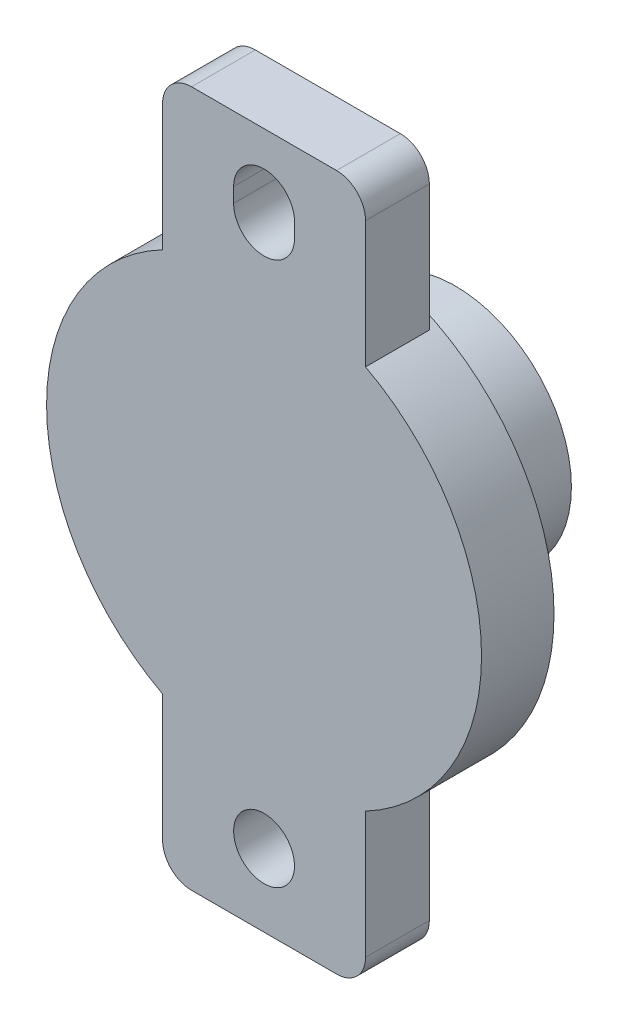
ISO-10303-21;
HEADER;
FILE_DESCRIPTION(('STEP AP214'),'2;1');
FILE_NAME('part.step','',(''),(''),'','','');
FILE_SCHEMA(('AUTOMOTIVE_DESIGN { 1 0 10303 214 1 1 1 1 }'));
ENDSEC;
DATA;
#1=APPLICATION_CONTEXT('core data for automotive mechanical design processes');
#2=APPLICATION_PROTOCOL_DEFINITION('international standard','automotive_design',2000,#1);
#3=PRODUCT_CONTEXT('',#1,'mechanical');
#4=PRODUCT('Part','Part','',(#3));
#5=PRODUCT_RELATED_PRODUCT_CATEGORY('part','',(#4));
#6=PRODUCT_DEFINITION_FORMATION('','',#4);
#7=PRODUCT_DEFINITION_CONTEXT('part definition',#1,'design');
#8=PRODUCT_DEFINITION('design','',#6,#7);
#9=PRODUCT_DEFINITION_SHAPE('','',#8);
#10=(LENGTH_UNIT() NAMED_UNIT(*) SI_UNIT(.MILLI.,.METRE.));
#11=(NAMED_UNIT(*) PLANE_ANGLE_UNIT() SI_UNIT($,.RADIAN.));
#12=(NAMED_UNIT(*) SI_UNIT($,.STERADIAN.) SOLID_ANGLE_UNIT());
#13=UNCERTAINTY_MEASURE_WITH_UNIT(LENGTH_MEASURE(1.E-05),#10,'distance_accuracy_value','');
#14=(GEOMETRIC_REPRESENTATION_CONTEXT(3) GLOBAL_UNCERTAINTY_ASSIGNED_CONTEXT((#13)) GLOBAL_UNIT_ASSIGNED_CONTEXT((#10,
#11,#12)) REPRESENTATION_CONTEXT('',''));
#15=CARTESIAN_POINT('',(0.,0.,0.));
#16=DIRECTION('',(0.,0.,1.));
#17=DIRECTION('',(1.,0.,0.));
#18=AXIS2_PLACEMENT_3D('',#15,#16,#17);
#19=CARTESIAN_POINT('',(0.,0.,-0.3));
#20=DIRECTION('',(0.,0.,1.));
#21=DIRECTION('',(1.,0.,0.));
#22=AXIS2_PLACEMENT_3D('',#19,#20,#21);
#23=PLANE('',#22);
#24=CARTESIAN_POINT('',(0.,0.,-0.3));
#25=DIRECTION('',(0.,0.,1.));
#26=DIRECTION('',(1.,0.,0.));
#27=AXIS2_PLACEMENT_3D('',#24,#25,#26);
#28=CIRCLE('',#27,7.5);
#29=CARTESIAN_POINT('',(7.5,0.,-0.3));
#30=VERTEX_POINT('',#29);
#31=EDGE_CURVE('E233',#30,#30,#28,.T.);
#32=ORIENTED_EDGE('',*,*,#31,.F.);
#33=EDGE_LOOP('',(#32));
#34=FACE_BOUND('',#33,.T.);
#35=CARTESIAN_POINT('',(0.,0.,-0.3));
#36=DIRECTION('',(0.,0.,1.));
#37=DIRECTION('',(1.,0.,0.));
#38=AXIS2_PLACEMENT_3D('',#35,#36,#37);
#39=CIRCLE('',#38,1.8);
#40=CARTESIAN_POINT('',(-1.29518338469886,1.25,-0.3));
#41=VERTEX_POINT('',#40);
#42=CARTESIAN_POINT('',(-1.29518338469886,-1.25,-0.3));
#43=VERTEX_POINT('',#42);
#44=EDGE_CURVE('E55',#41,#43,#39,.T.);
#45=ORIENTED_EDGE('',*,*,#44,.T.);
#46=DIRECTION('',(1.,0.,0.));
#47=VECTOR('',#46,1.);
#48=CARTESIAN_POINT('',(-1.29518338469886,-1.25,-0.3));
#49=LINE('',#48,#47);
#50=CARTESIAN_POINT('',(1.29518338469886,-1.25,-0.3));
#51=VERTEX_POINT('',#50);
#52=EDGE_CURVE('E639',#43,#51,#49,.T.);
#53=ORIENTED_EDGE('',*,*,#52,.T.);
#54=CARTESIAN_POINT('',(0.,0.,-0.3));
#55=DIRECTION('',(0.,0.,1.));
#56=DIRECTION('',(1.,0.,0.));
#57=AXIS2_PLACEMENT_3D('',#54,#55,#56);
#58=CIRCLE('',#57,1.8);
#59=CARTESIAN_POINT('',(1.29518338469886,1.25,-0.3));
#60=VERTEX_POINT('',#59);
#61=EDGE_CURVE('E200',#51,#60,#58,.T.);
#62=ORIENTED_EDGE('',*,*,#61,.T.);
#63=DIRECTION('',(-1.,0.,0.));
#64=VECTOR('',#63,1.);
#65=CARTESIAN_POINT('',(-1.29518338469886,1.25,-0.3));
#66=LINE('',#65,#64);
#67=EDGE_CURVE('E187',#60,#41,#66,.T.);
#68=ORIENTED_EDGE('',*,*,#67,.T.);
#69=EDGE_LOOP('',(#45,#53,#62,#68));
#70=FACE_BOUND('',#69,.T.);
#71=ADVANCED_FACE('F33',(#34,#70),#23,.F.);
#72=CARTESIAN_POINT('',(0.,0.,0.));
#73=DIRECTION('',(0.,0.,1.));
#74=DIRECTION('',(1.,0.,0.));
#75=AXIS2_PLACEMENT_3D('',#72,#73,#74);
#76=PLANE('',#75);
#77=DIRECTION('',(0.,-1.,0.));
#78=VECTOR('',#77,1.);
#79=CARTESIAN_POINT('',(1.05,9.74584047482982,0.));
#80=LINE('',#79,#78);
#81=CARTESIAN_POINT('',(1.05,9.74584047482982,0.));
#82=VERTEX_POINT('',#81);
#83=CARTESIAN_POINT('',(1.05,9.24584047482982,0.));
#84=VERTEX_POINT('',#83);
#85=EDGE_CURVE('E208',#82,#84,#80,.T.);
#86=ORIENTED_EDGE('',*,*,#85,.F.);
#87=CARTESIAN_POINT('',(0.,9.74584047482982,0.));
#88=DIRECTION('',(0.,0.,-1.));
#89=DIRECTION('',(-1.,0.,0.));
#90=AXIS2_PLACEMENT_3D('',#87,#88,#89);
#91=CIRCLE('',#90,1.05);
#92=CARTESIAN_POINT('',(-1.05,9.74584047482982,0.));
#93=VERTEX_POINT('',#92);
#94=EDGE_CURVE('E206',#93,#82,#91,.T.);
#95=ORIENTED_EDGE('',*,*,#94,.F.);
#96=DIRECTION('',(0.,1.,0.));
#97=VECTOR('',#96,1.);
#98=CARTESIAN_POINT('',(-1.05,9.74584047482982,0.));
#99=LINE('',#98,#97);
#100=CARTESIAN_POINT('',(-1.05,9.24584047482982,0.));
#101=VERTEX_POINT('',#100);
#102=EDGE_CURVE('E214',#101,#93,#99,.T.);
#103=ORIENTED_EDGE('',*,*,#102,.F.);
#104=CARTESIAN_POINT('',(0.,9.24584047482982,0.));
#105=DIRECTION('',(0.,0.,-1.));
#106=DIRECTION('',(-1.,0.,0.));
#107=AXIS2_PLACEMENT_3D('',#104,#105,#106);
#108=CIRCLE('',#107,1.05);
#109=EDGE_CURVE('E211',#84,#101,#108,.T.);
#110=ORIENTED_EDGE('',*,*,#109,.F.);
#111=EDGE_LOOP('',(#86,#95,#103,#110));
#112=FACE_BOUND('',#111,.T.);
#113=DIRECTION('',(0.,-1.,0.));
#114=VECTOR('',#113,1.);
#115=CARTESIAN_POINT('',(-3.5,12.,0.));
#116=LINE('',#115,#114);
#117=CARTESIAN_POINT('',(-3.5,11.,0.));
#118=VERTEX_POINT('',#117);
#119=CARTESIAN_POINT('',(-3.5,6.6332495807108,0.));
#120=VERTEX_POINT('',#119);
#121=EDGE_CURVE('E238',#118,#120,#116,.T.);
#122=ORIENTED_EDGE('',*,*,#121,.F.);
#123=CARTESIAN_POINT('',(-2.5,11.,0.));
#124=DIRECTION('',(0.,0.,1.));
#125=DIRECTION('',(1.,0.,0.));
#126=AXIS2_PLACEMENT_3D('',#123,#124,#125);
#127=CIRCLE('',#126,1.);
#128=CARTESIAN_POINT('',(-2.5,12.,0.));
#129=VERTEX_POINT('',#128);
#130=EDGE_CURVE('E317',#118,#129,#127,.F.);
#131=ORIENTED_EDGE('',*,*,#130,.T.);
#132=DIRECTION('',(-1.,0.,0.));
#133=VECTOR('',#132,1.);
#134=CARTESIAN_POINT('',(-3.5,12.,0.));
#135=LINE('',#134,#133);
#136=CARTESIAN_POINT('',(2.5,12.,0.));
#137=VERTEX_POINT('',#136);
#138=EDGE_CURVE('E242',#137,#129,#135,.T.);
#139=ORIENTED_EDGE('',*,*,#138,.F.);
#140=CARTESIAN_POINT('',(2.5,11.,0.));
#141=DIRECTION('',(0.,0.,1.));
#142=DIRECTION('',(1.,0.,0.));
#143=AXIS2_PLACEMENT_3D('',#140,#141,#142);
#144=CIRCLE('',#143,1.);
#145=CARTESIAN_POINT('',(3.5,11.,0.));
#146=VERTEX_POINT('',#145);
#147=EDGE_CURVE('E315',#137,#146,#144,.F.);
#148=ORIENTED_EDGE('',*,*,#147,.T.);
#149=DIRECTION('',(0.,1.,0.));
#150=VECTOR('',#149,1.);
#151=CARTESIAN_POINT('',(3.5,12.,0.));
#152=LINE('',#151,#150);
#153=CARTESIAN_POINT('',(3.5,6.6332495807108,0.));
#154=VERTEX_POINT('',#153);
#155=EDGE_CURVE('E270',#154,#146,#152,.T.);
#156=ORIENTED_EDGE('',*,*,#155,.F.);
#157=CARTESIAN_POINT('',(0.,0.,0.));
#158=DIRECTION('',(0.,0.,1.));
#159=DIRECTION('',(1.,0.,0.));
#160=AXIS2_PLACEMENT_3D('',#157,#158,#159);
#161=CIRCLE('',#160,7.5);
#162=EDGE_CURVE('E289',#154,#120,#161,.T.);
#163=ORIENTED_EDGE('',*,*,#162,.T.);
#164=EDGE_LOOP('',(#122,#131,#139,#148,#156,#163));
#165=FACE_BOUND('',#164,.T.);
#166=ADVANCED_FACE('F342',(#112,#165),#76,.F.);
#167=CARTESIAN_POINT('',(-3.5,12.,2.2));
#168=DIRECTION('',(1.,0.,0.));
#169=DIRECTION('',(0.,1.,0.));
#170=AXIS2_PLACEMENT_3D('',#167,#168,#169);
#171=PLANE('',#170);
#172=DIRECTION('',(0.,-1.,0.));
#173=VECTOR('',#172,1.);
#174=CARTESIAN_POINT('',(-3.5,12.,2.2));
#175=LINE('',#174,#173);
#176=CARTESIAN_POINT('',(-3.5,11.,2.2));
#177=VERTEX_POINT('',#176);
#178=CARTESIAN_POINT('',(-3.5,6.6332495807108,2.2));
#179=VERTEX_POINT('',#178);
#180=EDGE_CURVE('E239',#177,#179,#175,.T.);
#181=ORIENTED_EDGE('',*,*,#180,.F.);
#182=DIRECTION('',(0.,0.,-1.));
#183=VECTOR('',#182,1.);
#184=CARTESIAN_POINT('',(-3.5,11.,2.2));
#185=LINE('',#184,#183);
#186=EDGE_CURVE('E312',#177,#118,#185,.T.);
#187=ORIENTED_EDGE('',*,*,#186,.T.);
#188=ORIENTED_EDGE('',*,*,#121,.T.);
#189=DIRECTION('',(0.,0.,-1.));
#190=VECTOR('',#189,1.);
#191=CARTESIAN_POINT('',(-3.5,6.6332495807108,2.2));
#192=LINE('',#191,#190);
#193=EDGE_CURVE('E283',#179,#120,#192,.T.);
#194=ORIENTED_EDGE('',*,*,#193,.F.);
#195=EDGE_LOOP('',(#181,#187,#188,#194));
#196=FACE_BOUND('',#195,.T.);
#197=ADVANCED_FACE('F350',(#196),#171,.F.);
#198=CARTESIAN_POINT('',(-3.5,-6.6332495807108,2.2));
#199=DIRECTION('',(1.,0.,0.));
#200=DIRECTION('',(0.,1.,0.));
#201=AXIS2_PLACEMENT_3D('',#198,#199,#200);
#202=PLANE('',#201);
#203=DIRECTION('',(0.,-1.,0.));
#204=VECTOR('',#203,1.);
#205=CARTESIAN_POINT('',(-3.5,-6.6332495807108,0.));
#206=LINE('',#205,#204);
#207=CARTESIAN_POINT('',(-3.5,-6.6332495807108,0.));
#208=VERTEX_POINT('',#207);
#209=CARTESIAN_POINT('',(-3.5,-11.,0.));
#210=VERTEX_POINT('',#209);
#211=EDGE_CURVE('E262',#208,#210,#206,.T.);
#212=ORIENTED_EDGE('',*,*,#211,.T.);
#213=DIRECTION('',(0.,0.,-1.));
#214=VECTOR('',#213,1.);
#215=CARTESIAN_POINT('',(-3.5,-11.,2.2));
#216=LINE('',#215,#214);
#217=CARTESIAN_POINT('',(-3.5,-11.,2.2));
#218=VERTEX_POINT('',#217);
#219=EDGE_CURVE('E310',#210,#218,#216,.F.);
#220=ORIENTED_EDGE('',*,*,#219,.T.);
#221=DIRECTION('',(0.,-1.,0.));
#222=VECTOR('',#221,1.);
#223=CARTESIAN_POINT('',(-3.5,-6.6332495807108,2.2));
#224=LINE('',#223,#222);
#225=CARTESIAN_POINT('',(-3.5,-6.6332495807108,2.2));
#226=VERTEX_POINT('',#225);
#227=EDGE_CURVE('E244',#226,#218,#224,.T.);
#228=ORIENTED_EDGE('',*,*,#227,.F.);
#229=DIRECTION('',(0.,0.,-1.));
#230=VECTOR('',#229,1.);
#231=CARTESIAN_POINT('',(-3.5,-6.6332495807108,2.2));
#232=LINE('',#231,#230);
#233=EDGE_CURVE('E280',#226,#208,#232,.T.);
#234=ORIENTED_EDGE('',*,*,#233,.T.);
#235=EDGE_LOOP('',(#212,#220,#228,#234));
#236=FACE_BOUND('',#235,.T.);
#237=ADVANCED_FACE('F360',(#236),#202,.F.);
#238=CARTESIAN_POINT('',(-3.5,-12.,2.2));
#239=DIRECTION('',(0.,1.,0.));
#240=DIRECTION('',(0.,0.,1.));
#241=AXIS2_PLACEMENT_3D('',#238,#239,#240);
#242=PLANE('',#241);
#243=DIRECTION('',(1.,0.,0.));
#244=VECTOR('',#243,1.);
#245=CARTESIAN_POINT('',(-3.5,-12.,0.));
#246=LINE('',#245,#244);
#247=CARTESIAN_POINT('',(-2.5,-12.,0.));
#248=VERTEX_POINT('',#247);
#249=CARTESIAN_POINT('',(2.5,-12.,0.));
#250=VERTEX_POINT('',#249);
#251=EDGE_CURVE('E265',#248,#250,#246,.T.);
#252=ORIENTED_EDGE('',*,*,#251,.T.);
#253=DIRECTION('',(0.,0.,-1.));
#254=VECTOR('',#253,1.);
#255=CARTESIAN_POINT('',(2.5,-12.,2.2));
#256=LINE('',#255,#254);
#257=CARTESIAN_POINT('',(2.5,-12.,2.2));
#258=VERTEX_POINT('',#257);
#259=EDGE_CURVE('E300',#250,#258,#256,.F.);
#260=ORIENTED_EDGE('',*,*,#259,.T.);
#261=DIRECTION('',(1.,0.,0.));
#262=VECTOR('',#261,1.);
#263=CARTESIAN_POINT('',(-3.5,-12.,2.2));
#264=LINE('',#263,#262);
#265=CARTESIAN_POINT('',(-2.5,-12.,2.2));
#266=VERTEX_POINT('',#265);
#267=EDGE_CURVE('E247',#266,#258,#264,.T.);
#268=ORIENTED_EDGE('',*,*,#267,.F.);
#269=DIRECTION('',(0.,0.,-1.));
#270=VECTOR('',#269,1.);
#271=CARTESIAN_POINT('',(-2.5,-12.,2.2));
#272=LINE('',#271,#270);
#273=EDGE_CURVE('E297',#266,#248,#272,.T.);
#274=ORIENTED_EDGE('',*,*,#273,.T.);
#275=EDGE_LOOP('',(#252,#260,#268,#274));
#276=FACE_BOUND('',#275,.T.);
#277=ADVANCED_FACE('F369',(#276),#242,.F.);
#278=CARTESIAN_POINT('',(3.5,-6.6332495807108,2.2));
#279=DIRECTION('',(-1.,0.,0.));
#280=DIRECTION('',(0.,-1.,0.));
#281=AXIS2_PLACEMENT_3D('',#278,#279,#280);
#282=PLANE('',#281);
#283=DIRECTION('',(0.,1.,0.));
#284=VECTOR('',#283,1.);
#285=CARTESIAN_POINT('',(3.5,-6.6332495807108,2.2));
#286=LINE('',#285,#284);
#287=CARTESIAN_POINT('',(3.5,-11.,2.2));
#288=VERTEX_POINT('',#287);
#289=CARTESIAN_POINT('',(3.5,-6.6332495807108,2.2));
#290=VERTEX_POINT('',#289);
#291=EDGE_CURVE('E250',#288,#290,#286,.T.);
#292=ORIENTED_EDGE('',*,*,#291,.F.);
#293=DIRECTION('',(0.,0.,-1.));
#294=VECTOR('',#293,1.);
#295=CARTESIAN_POINT('',(3.5,-11.,2.2));
#296=LINE('',#295,#294);
#297=CARTESIAN_POINT('',(3.5,-11.,0.));
#298=VERTEX_POINT('',#297);
#299=EDGE_CURVE('E290',#288,#298,#296,.T.);
#300=ORIENTED_EDGE('',*,*,#299,.T.);
#301=DIRECTION('',(0.,1.,0.));
#302=VECTOR('',#301,1.);
#303=CARTESIAN_POINT('',(3.5,-6.6332495807108,0.));
#304=LINE('',#303,#302);
#305=CARTESIAN_POINT('',(3.5,-6.6332495807108,0.));
#306=VERTEX_POINT('',#305);
#307=EDGE_CURVE('E268',#298,#306,#304,.T.);
#308=ORIENTED_EDGE('',*,*,#307,.T.);
#309=DIRECTION('',(0.,0.,-1.));
#310=VECTOR('',#309,1.);
#311=CARTESIAN_POINT('',(3.5,-6.6332495807108,2.2));
#312=LINE('',#311,#310);
#313=EDGE_CURVE('E277',#290,#306,#312,.T.);
#314=ORIENTED_EDGE('',*,*,#313,.F.);
#315=EDGE_LOOP('',(#292,#300,#308,#314));
#316=FACE_BOUND('',#315,.T.);
#317=ADVANCED_FACE('F380',(#316),#282,.F.);
#318=CARTESIAN_POINT('',(0.,0.,2.2));
#319=DIRECTION('',(0.,0.,-1.));
#320=DIRECTION('',(-1.,0.,0.));
#321=AXIS2_PLACEMENT_3D('',#318,#319,#320);
#322=CYLINDRICAL_SURFACE('',#321,7.5);
#323=ORIENTED_EDGE('',*,*,#313,.T.);
#324=EDGE_CURVE('E286',#208,#306,#161,.T.);
#325=ORIENTED_EDGE('',*,*,#324,.F.);
#326=ORIENTED_EDGE('',*,*,#233,.F.);
#327=CARTESIAN_POINT('',(0.,0.,2.2));
#328=DIRECTION('',(0.,0.,1.));
#329=DIRECTION('',(1.,0.,0.));
#330=AXIS2_PLACEMENT_3D('',#327,#328,#329);
#331=CIRCLE('',#330,7.5);
#332=EDGE_CURVE('E241',#179,#226,#331,.T.);
#333=ORIENTED_EDGE('',*,*,#332,.F.);
#334=ORIENTED_EDGE('',*,*,#193,.T.);
#335=ORIENTED_EDGE('',*,*,#162,.F.);
#336=DIRECTION('',(0.,0.,-1.));
#337=VECTOR('',#336,1.);
#338=CARTESIAN_POINT('',(3.5,6.6332495807108,2.2));
#339=LINE('',#338,#337);
#340=CARTESIAN_POINT('',(3.5,6.6332495807108,2.2));
#341=VERTEX_POINT('',#340);
#342=EDGE_CURVE('E260',#341,#154,#339,.T.);
#343=ORIENTED_EDGE('',*,*,#342,.F.);
#344=CARTESIAN_POINT('',(0.,0.,2.2));
#345=DIRECTION('',(0.,0.,1.));
#346=DIRECTION('',(1.,0.,0.));
#347=AXIS2_PLACEMENT_3D('',#344,#345,#346);
#348=CIRCLE('',#347,7.5);
#349=EDGE_CURVE('E252',#290,#341,#348,.T.);
#350=ORIENTED_EDGE('',*,*,#349,.F.);
#351=EDGE_LOOP('',(#323,#325,#326,#333,#334,#335,#343,#350));
#352=FACE_BOUND('',#351,.T.);
#353=ORIENTED_EDGE('',*,*,#31,.T.);
#354=EDGE_LOOP('',(#353));
#355=FACE_BOUND('',#354,.T.);
#356=ADVANCED_FACE('F355',(#352,#355),#322,.T.);
#357=CARTESIAN_POINT('',(3.5,12.,2.2));
#358=DIRECTION('',(-1.,0.,0.));
#359=DIRECTION('',(0.,-1.,0.));
#360=AXIS2_PLACEMENT_3D('',#357,#358,#359);
#361=PLANE('',#360);
#362=ORIENTED_EDGE('',*,*,#155,.T.);
#363=DIRECTION('',(0.,0.,-1.));
#364=VECTOR('',#363,1.);
#365=CARTESIAN_POINT('',(3.5,11.,2.2));
#366=LINE('',#365,#364);
#367=CARTESIAN_POINT('',(3.5,11.,2.2));
#368=VERTEX_POINT('',#367);
#369=EDGE_CURVE('E41',#146,#368,#366,.F.);
#370=ORIENTED_EDGE('',*,*,#369,.T.);
#371=DIRECTION('',(0.,1.,0.));
#372=VECTOR('',#371,1.);
#373=CARTESIAN_POINT('',(3.5,12.,2.2));
#374=LINE('',#373,#372);
#375=EDGE_CURVE('E254',#341,#368,#374,.T.);
#376=ORIENTED_EDGE('',*,*,#375,.F.);
#377=ORIENTED_EDGE('',*,*,#342,.T.);
#378=EDGE_LOOP('',(#362,#370,#376,#377));
#379=FACE_BOUND('',#378,.T.);
#380=ADVANCED_FACE('F326',(#379),#361,.F.);
#381=CARTESIAN_POINT('',(-3.5,12.,2.2));
#382=DIRECTION('',(0.,-1.,0.));
#383=DIRECTION('',(0.,0.,-1.));
#384=AXIS2_PLACEMENT_3D('',#381,#382,#383);
#385=PLANE('',#384);
#386=ORIENTED_EDGE('',*,*,#138,.T.);
#387=DIRECTION('',(0.,0.,-1.));
#388=VECTOR('',#387,1.);
#389=CARTESIAN_POINT('',(-2.5,12.,2.2));
#390=LINE('',#389,#388);
#391=CARTESIAN_POINT('',(-2.5,12.,2.2));
#392=VERTEX_POINT('',#391);
#393=EDGE_CURVE('E322',#129,#392,#390,.F.);
#394=ORIENTED_EDGE('',*,*,#393,.T.);
#395=DIRECTION('',(-1.,0.,0.));
#396=VECTOR('',#395,1.);
#397=CARTESIAN_POINT('',(-3.5,12.,2.2));
#398=LINE('',#397,#396);
#399=CARTESIAN_POINT('',(2.5,12.,2.2));
#400=VERTEX_POINT('',#399);
#401=EDGE_CURVE('E257',#400,#392,#398,.T.);
#402=ORIENTED_EDGE('',*,*,#401,.F.);
#403=DIRECTION('',(0.,0.,-1.));
#404=VECTOR('',#403,1.);
#405=CARTESIAN_POINT('',(2.5,12.,2.2));
#406=LINE('',#405,#404);
#407=EDGE_CURVE('E319',#400,#137,#406,.T.);
#408=ORIENTED_EDGE('',*,*,#407,.T.);
#409=EDGE_LOOP('',(#386,#394,#402,#408));
#410=FACE_BOUND('',#409,.T.);
#411=ADVANCED_FACE('F338',(#410),#385,.F.);
#412=CARTESIAN_POINT('',(0.,0.,2.2));
#413=DIRECTION('',(0.,0.,1.));
#414=DIRECTION('',(1.,0.,0.));
#415=AXIS2_PLACEMENT_3D('',#412,#413,#414);
#416=PLANE('',#415);
#417=CARTESIAN_POINT('',(0.,9.74584047482982,2.2));
#418=DIRECTION('',(0.,0.,1.));
#419=DIRECTION('',(1.,0.,0.));
#420=AXIS2_PLACEMENT_3D('',#417,#418,#419);
#421=CIRCLE('',#420,1.05);
#422=CARTESIAN_POINT('',(-1.05,9.74584047482982,2.2));
#423=VERTEX_POINT('',#422);
#424=CARTESIAN_POINT('',(1.05,9.74584047482982,2.2));
#425=VERTEX_POINT('',#424);
#426=EDGE_CURVE('E203',#423,#425,#421,.F.);
#427=ORIENTED_EDGE('',*,*,#426,.T.);
#428=DIRECTION('',(0.,-1.,0.));
#429=VECTOR('',#428,1.);
#430=CARTESIAN_POINT('',(1.05,9.74584047482982,2.2));
#431=LINE('',#430,#429);
#432=CARTESIAN_POINT('',(1.05,9.24584047482982,2.2));
#433=VERTEX_POINT('',#432);
#434=EDGE_CURVE('E220',#425,#433,#431,.T.);
#435=ORIENTED_EDGE('',*,*,#434,.T.);
#436=CARTESIAN_POINT('',(0.,9.24584047482982,2.2));
#437=DIRECTION('',(0.,0.,1.));
#438=DIRECTION('',(1.,0.,0.));
#439=AXIS2_PLACEMENT_3D('',#436,#437,#438);
#440=CIRCLE('',#439,1.05);
#441=CARTESIAN_POINT('',(-1.05,9.24584047482982,2.2));
#442=VERTEX_POINT('',#441);
#443=EDGE_CURVE('E196',#433,#442,#440,.F.);
#444=ORIENTED_EDGE('',*,*,#443,.T.);
#445=DIRECTION('',(0.,1.,0.));
#446=VECTOR('',#445,1.);
#447=CARTESIAN_POINT('',(-1.05,9.74584047482982,2.2));
#448=LINE('',#447,#446);
#449=EDGE_CURVE('E199',#442,#423,#448,.T.);
#450=ORIENTED_EDGE('',*,*,#449,.T.);
#451=EDGE_LOOP('',(#427,#435,#444,#450));
#452=FACE_BOUND('',#451,.T.);
#453=CARTESIAN_POINT('',(0.,-9.5,2.2));
#454=DIRECTION('',(0.,0.,-1.));
#455=DIRECTION('',(-1.,0.,0.));
#456=AXIS2_PLACEMENT_3D('',#453,#454,#455);
#457=CIRCLE('',#456,1.05);
#458=CARTESIAN_POINT('',(-1.05,-9.5,2.2));
#459=VERTEX_POINT('',#458);
#460=EDGE_CURVE('E230',#459,#459,#457,.T.);
#461=ORIENTED_EDGE('',*,*,#460,.T.);
#462=EDGE_LOOP('',(#461));
#463=FACE_BOUND('',#462,.T.);
#464=ORIENTED_EDGE('',*,*,#267,.T.);
#465=CARTESIAN_POINT('',(2.5,-11.,2.2));
#466=DIRECTION('',(0.,0.,1.));
#467=DIRECTION('',(1.,0.,0.));
#468=AXIS2_PLACEMENT_3D('',#465,#466,#467);
#469=CIRCLE('',#468,1.);
#470=EDGE_CURVE('E308',#258,#288,#469,.T.);
#471=ORIENTED_EDGE('',*,*,#470,.T.);
#472=ORIENTED_EDGE('',*,*,#291,.T.);
#473=ORIENTED_EDGE('',*,*,#349,.T.);
#474=ORIENTED_EDGE('',*,*,#375,.T.);
#475=CARTESIAN_POINT('',(2.5,11.,2.2));
#476=DIRECTION('',(0.,0.,1.));
#477=DIRECTION('',(1.,0.,0.));
#478=AXIS2_PLACEMENT_3D('',#475,#476,#477);
#479=CIRCLE('',#478,1.);
#480=EDGE_CURVE('E302',#368,#400,#479,.T.);
#481=ORIENTED_EDGE('',*,*,#480,.T.);
#482=ORIENTED_EDGE('',*,*,#401,.T.);
#483=CARTESIAN_POINT('',(-2.5,11.,2.2));
#484=DIRECTION('',(0.,0.,1.));
#485=DIRECTION('',(1.,0.,0.));
#486=AXIS2_PLACEMENT_3D('',#483,#484,#485);
#487=CIRCLE('',#486,1.);
#488=EDGE_CURVE('E304',#392,#177,#487,.T.);
#489=ORIENTED_EDGE('',*,*,#488,.T.);
#490=ORIENTED_EDGE('',*,*,#180,.T.);
#491=ORIENTED_EDGE('',*,*,#332,.T.);
#492=ORIENTED_EDGE('',*,*,#227,.T.);
#493=CARTESIAN_POINT('',(-2.5,-11.,2.2));
#494=DIRECTION('',(0.,0.,1.));
#495=DIRECTION('',(1.,0.,0.));
#496=AXIS2_PLACEMENT_3D('',#493,#494,#495);
#497=CIRCLE('',#496,1.);
#498=EDGE_CURVE('E306',#218,#266,#497,.T.);
#499=ORIENTED_EDGE('',*,*,#498,.T.);
#500=EDGE_LOOP('',(#464,#471,#472,#473,#474,#481,#482,#489,#490,#491,#492,#499));
#501=FACE_BOUND('',#500,.T.);
#502=ADVANCED_FACE('F331',(#452,#463,#501),#416,.T.);
#503=CARTESIAN_POINT('',(0.,-9.5,0.));
#504=DIRECTION('',(0.,0.,-1.));
#505=DIRECTION('',(-1.,0.,0.));
#506=AXIS2_PLACEMENT_3D('',#503,#504,#505);
#507=CIRCLE('',#506,1.05);
#508=CARTESIAN_POINT('',(-1.05,-9.5,0.));
#509=VERTEX_POINT('',#508);
#510=EDGE_CURVE('E229',#509,#509,#507,.T.);
#511=ORIENTED_EDGE('',*,*,#510,.F.);
#512=EDGE_LOOP('',(#511));
#513=FACE_BOUND('',#512,.T.);
#514=ORIENTED_EDGE('',*,*,#307,.F.);
#515=CARTESIAN_POINT('',(2.5,-11.,0.));
#516=DIRECTION('',(0.,0.,1.));
#517=DIRECTION('',(1.,0.,0.));
#518=AXIS2_PLACEMENT_3D('',#515,#516,#517);
#519=CIRCLE('',#518,1.);
#520=EDGE_CURVE('E295',#298,#250,#519,.F.);
#521=ORIENTED_EDGE('',*,*,#520,.T.);
#522=ORIENTED_EDGE('',*,*,#251,.F.);
#523=CARTESIAN_POINT('',(-2.5,-11.,0.));
#524=DIRECTION('',(0.,0.,1.));
#525=DIRECTION('',(1.,0.,0.));
#526=AXIS2_PLACEMENT_3D('',#523,#524,#525);
#527=CIRCLE('',#526,1.);
#528=EDGE_CURVE('E293',#248,#210,#527,.F.);
#529=ORIENTED_EDGE('',*,*,#528,.T.);
#530=ORIENTED_EDGE('',*,*,#211,.F.);
#531=ORIENTED_EDGE('',*,*,#324,.T.);
#532=EDGE_LOOP('',(#514,#521,#522,#529,#530,#531));
#533=FACE_BOUND('',#532,.T.);
#534=ADVANCED_FACE('F373',(#513,#533),#76,.F.);
#535=CARTESIAN_POINT('',(0.,-9.5,2.2));
#536=DIRECTION('',(0.,0.,-1.));
#537=DIRECTION('',(-1.,0.,0.));
#538=AXIS2_PLACEMENT_3D('',#535,#536,#537);
#539=CYLINDRICAL_SURFACE('',#538,1.05);
#540=ORIENTED_EDGE('',*,*,#460,.F.);
#541=EDGE_LOOP('',(#540));
#542=FACE_BOUND('',#541,.T.);
#543=ORIENTED_EDGE('',*,*,#510,.T.);
#544=EDGE_LOOP('',(#543));
#545=FACE_BOUND('',#544,.T.);
#546=ADVANCED_FACE('F401',(#542,#545),#539,.F.);
#547=CARTESIAN_POINT('',(0.,9.74584047482982,2.201));
#548=DIRECTION('',(0.,0.,-1.));
#549=DIRECTION('',(-1.,0.,0.));
#550=AXIS2_PLACEMENT_3D('',#547,#548,#549);
#551=CYLINDRICAL_SURFACE('',#550,1.05);
#552=DIRECTION('',(0.,0.,-1.));
#553=VECTOR('',#552,1.);
#554=CARTESIAN_POINT('',(-1.05,9.74584047482982,2.201));
#555=LINE('',#554,#553);
#556=EDGE_CURVE('E218',#423,#93,#555,.T.);
#557=ORIENTED_EDGE('',*,*,#556,.T.);
#558=ORIENTED_EDGE('',*,*,#94,.T.);
#559=DIRECTION('',(0.,0.,-1.));
#560=VECTOR('',#559,1.);
#561=CARTESIAN_POINT('',(1.05,9.74584047482982,2.201));
#562=LINE('',#561,#560);
#563=EDGE_CURVE('E217',#425,#82,#562,.T.);
#564=ORIENTED_EDGE('',*,*,#563,.F.);
#565=ORIENTED_EDGE('',*,*,#426,.F.);
#566=EDGE_LOOP('',(#557,#558,#564,#565));
#567=FACE_BOUND('',#566,.T.);
#568=ADVANCED_FACE('F434',(#567),#551,.F.);
#569=CARTESIAN_POINT('',(-1.05,9.74584047482982,2.201));
#570=DIRECTION('',(-1.,0.,0.));
#571=DIRECTION('',(0.,-1.,0.));
#572=AXIS2_PLACEMENT_3D('',#569,#570,#571);
#573=PLANE('',#572);
#574=DIRECTION('',(0.,0.,-1.));
#575=VECTOR('',#574,1.);
#576=CARTESIAN_POINT('',(-1.05,9.24584047482982,2.201));
#577=LINE('',#576,#575);
#578=EDGE_CURVE('E221',#442,#101,#577,.T.);
#579=ORIENTED_EDGE('',*,*,#578,.T.);
#580=ORIENTED_EDGE('',*,*,#102,.T.);
#581=ORIENTED_EDGE('',*,*,#556,.F.);
#582=ORIENTED_EDGE('',*,*,#449,.F.);
#583=EDGE_LOOP('',(#579,#580,#581,#582));
#584=FACE_BOUND('',#583,.T.);
#585=ADVANCED_FACE('F441',(#584),#573,.F.);
#586=CARTESIAN_POINT('',(0.,9.24584047482982,2.201));
#587=DIRECTION('',(0.,0.,-1.));
#588=DIRECTION('',(-1.,0.,0.));
#589=AXIS2_PLACEMENT_3D('',#586,#587,#588);
#590=CYLINDRICAL_SURFACE('',#589,1.05);
#591=DIRECTION('',(0.,0.,-1.));
#592=VECTOR('',#591,1.);
#593=CARTESIAN_POINT('',(1.05,9.24584047482982,2.201));
#594=LINE('',#593,#592);
#595=EDGE_CURVE('E223',#433,#84,#594,.T.);
#596=ORIENTED_EDGE('',*,*,#595,.T.);
#597=ORIENTED_EDGE('',*,*,#109,.T.);
#598=ORIENTED_EDGE('',*,*,#578,.F.);
#599=ORIENTED_EDGE('',*,*,#443,.F.);
#600=EDGE_LOOP('',(#596,#597,#598,#599));
#601=FACE_BOUND('',#600,.T.);
#602=ADVANCED_FACE('F448',(#601),#590,.F.);
#603=CARTESIAN_POINT('',(1.05,9.74584047482982,2.201));
#604=DIRECTION('',(1.,0.,0.));
#605=DIRECTION('',(0.,1.,0.));
#606=AXIS2_PLACEMENT_3D('',#603,#604,#605);
#607=PLANE('',#606);
#608=ORIENTED_EDGE('',*,*,#563,.T.);
#609=ORIENTED_EDGE('',*,*,#85,.T.);
#610=ORIENTED_EDGE('',*,*,#595,.F.);
#611=ORIENTED_EDGE('',*,*,#434,.F.);
#612=EDGE_LOOP('',(#608,#609,#610,#611));
#613=FACE_BOUND('',#612,.T.);
#614=ADVANCED_FACE('F456',(#613),#607,.F.);
#615=CARTESIAN_POINT('',(2.5,-11.,2.2));
#616=DIRECTION('',(0.,0.,-1.));
#617=DIRECTION('',(-1.,0.,0.));
#618=AXIS2_PLACEMENT_3D('',#615,#616,#617);
#619=CYLINDRICAL_SURFACE('',#618,1.);
#620=ORIENTED_EDGE('',*,*,#470,.F.);
#621=ORIENTED_EDGE('',*,*,#259,.F.);
#622=ORIENTED_EDGE('',*,*,#520,.F.);
#623=ORIENTED_EDGE('',*,*,#299,.F.);
#624=EDGE_LOOP('',(#620,#621,#622,#623));
#625=FACE_BOUND('',#624,.T.);
#626=ADVANCED_FACE('F377',(#625),#619,.T.);
#627=CARTESIAN_POINT('',(-2.5,-11.,2.2));
#628=DIRECTION('',(0.,0.,-1.));
#629=DIRECTION('',(-1.,0.,0.));
#630=AXIS2_PLACEMENT_3D('',#627,#628,#629);
#631=CYLINDRICAL_SURFACE('',#630,1.);
#632=ORIENTED_EDGE('',*,*,#498,.F.);
#633=ORIENTED_EDGE('',*,*,#219,.F.);
#634=ORIENTED_EDGE('',*,*,#528,.F.);
#635=ORIENTED_EDGE('',*,*,#273,.F.);
#636=EDGE_LOOP('',(#632,#633,#634,#635));
#637=FACE_BOUND('',#636,.T.);
#638=ADVANCED_FACE('F366',(#637),#631,.T.);
#639=CARTESIAN_POINT('',(-2.5,11.,2.2));
#640=DIRECTION('',(0.,0.,-1.));
#641=DIRECTION('',(-1.,0.,0.));
#642=AXIS2_PLACEMENT_3D('',#639,#640,#641);
#643=CYLINDRICAL_SURFACE('',#642,1.);
#644=ORIENTED_EDGE('',*,*,#488,.F.);
#645=ORIENTED_EDGE('',*,*,#393,.F.);
#646=ORIENTED_EDGE('',*,*,#130,.F.);
#647=ORIENTED_EDGE('',*,*,#186,.F.);
#648=EDGE_LOOP('',(#644,#645,#646,#647));
#649=FACE_BOUND('',#648,.T.);
#650=ADVANCED_FACE('F347',(#649),#643,.T.);
#651=CARTESIAN_POINT('',(2.5,11.,2.2));
#652=DIRECTION('',(0.,0.,-1.));
#653=DIRECTION('',(-1.,0.,0.));
#654=AXIS2_PLACEMENT_3D('',#651,#652,#653);
#655=CYLINDRICAL_SURFACE('',#654,1.);
#656=ORIENTED_EDGE('',*,*,#480,.F.);
#657=ORIENTED_EDGE('',*,*,#369,.F.);
#658=ORIENTED_EDGE('',*,*,#147,.F.);
#659=ORIENTED_EDGE('',*,*,#407,.F.);
#660=EDGE_LOOP('',(#656,#657,#658,#659));
#661=FACE_BOUND('',#660,.T.);
#662=ADVANCED_FACE('F35',(#661),#655,.T.);
#663=CARTESIAN_POINT('',(0.,0.,4.08292140016223));
#664=DIRECTION('',(0.,0.,-1.));
#665=DIRECTION('',(-1.,0.,0.));
#666=AXIS2_PLACEMENT_3D('',#663,#664,#665);
#667=CYLINDRICAL_SURFACE('',#666,1.8);
#668=DIRECTION('',(0.,0.,-1.));
#669=VECTOR('',#668,1.);
#670=CARTESIAN_POINT('',(-1.29518338469886,1.25,4.08292140016223));
#671=LINE('',#670,#669);
#672=CARTESIAN_POINT('',(-1.29518338469886,1.25,-0.699999999999999));
#673=VERTEX_POINT('',#672);
#674=EDGE_CURVE('E194',#41,#673,#671,.T.);
#675=ORIENTED_EDGE('',*,*,#674,.T.);
#676=CARTESIAN_POINT('',(0.,0.,-0.699999999999999));
#677=DIRECTION('',(0.,0.,1.));
#678=DIRECTION('',(1.,0.,0.));
#679=AXIS2_PLACEMENT_3D('',#676,#677,#678);
#680=CIRCLE('',#679,1.8);
#681=CARTESIAN_POINT('',(-1.29518338469886,-1.25,-0.699999999999999));
#682=VERTEX_POINT('',#681);
#683=EDGE_CURVE('E48',#673,#682,#680,.T.);
#684=ORIENTED_EDGE('',*,*,#683,.T.);
#685=DIRECTION('',(0.,0.,-1.));
#686=VECTOR('',#685,1.);
#687=CARTESIAN_POINT('',(-1.29518338469886,-1.25,4.08292140016223));
#688=LINE('',#687,#686);
#689=EDGE_CURVE('E190',#43,#682,#688,.T.);
#690=ORIENTED_EDGE('',*,*,#689,.F.);
#691=ORIENTED_EDGE('',*,*,#44,.F.);
#692=EDGE_LOOP('',(#675,#684,#690,#691));
#693=FACE_BOUND('',#692,.T.);
#694=ADVANCED_FACE('F488',(#693),#667,.T.);
#695=CARTESIAN_POINT('',(-1.29518338469886,-1.25,4.08292140016223));
#696=DIRECTION('',(0.,1.,0.));
#697=DIRECTION('',(0.,0.,1.));
#698=AXIS2_PLACEMENT_3D('',#695,#696,#697);
#699=PLANE('',#698);
#700=ORIENTED_EDGE('',*,*,#689,.T.);
#701=DIRECTION('',(1.,0.,0.));
#702=VECTOR('',#701,1.);
#703=CARTESIAN_POINT('',(-1.29518338469886,-1.25,-0.699999999999999));
#704=LINE('',#703,#702);
#705=CARTESIAN_POINT('',(1.29518338469886,-1.25,-0.699999999999999));
#706=VERTEX_POINT('',#705);
#707=EDGE_CURVE('E183',#682,#706,#704,.T.);
#708=ORIENTED_EDGE('',*,*,#707,.T.);
#709=DIRECTION('',(0.,0.,-1.));
#710=VECTOR('',#709,1.);
#711=CARTESIAN_POINT('',(1.29518338469886,-1.25,4.08292140016223));
#712=LINE('',#711,#710);
#713=EDGE_CURVE('E182',#51,#706,#712,.T.);
#714=ORIENTED_EDGE('',*,*,#713,.F.);
#715=ORIENTED_EDGE('',*,*,#52,.F.);
#716=EDGE_LOOP('',(#700,#708,#714,#715));
#717=FACE_BOUND('',#716,.T.);
#718=ADVANCED_FACE('F494',(#717),#699,.F.);
#719=CARTESIAN_POINT('',(0.,0.,4.08292140016223));
#720=DIRECTION('',(0.,0.,-1.));
#721=DIRECTION('',(-1.,0.,0.));
#722=AXIS2_PLACEMENT_3D('',#719,#720,#721);
#723=CYLINDRICAL_SURFACE('',#722,1.8);
#724=ORIENTED_EDGE('',*,*,#713,.T.);
#725=CARTESIAN_POINT('',(0.,0.,-0.699999999999999));
#726=DIRECTION('',(0.,0.,1.));
#727=DIRECTION('',(1.,0.,0.));
#728=AXIS2_PLACEMENT_3D('',#725,#726,#727);
#729=CIRCLE('',#728,1.8);
#730=CARTESIAN_POINT('',(1.29518338469886,1.25,-0.699999999999999));
#731=VERTEX_POINT('',#730);
#732=EDGE_CURVE('E168',#706,#731,#729,.T.);
#733=ORIENTED_EDGE('',*,*,#732,.T.);
#734=DIRECTION('',(0.,0.,-1.));
#735=VECTOR('',#734,1.);
#736=CARTESIAN_POINT('',(1.29518338469886,1.25,4.08292140016223));
#737=LINE('',#736,#735);
#738=EDGE_CURVE('E179',#60,#731,#737,.T.);
#739=ORIENTED_EDGE('',*,*,#738,.F.);
#740=ORIENTED_EDGE('',*,*,#61,.F.);
#741=EDGE_LOOP('',(#724,#733,#739,#740));
#742=FACE_BOUND('',#741,.T.);
#743=ADVANCED_FACE('F177',(#742),#723,.T.);
#744=CARTESIAN_POINT('',(-1.29518338469886,1.25,4.08292140016223));
#745=DIRECTION('',(0.,-1.,0.));
#746=DIRECTION('',(0.,0.,-1.));
#747=AXIS2_PLACEMENT_3D('',#744,#745,#746);
#748=PLANE('',#747);
#749=ORIENTED_EDGE('',*,*,#738,.T.);
#750=DIRECTION('',(-1.,0.,0.));
#751=VECTOR('',#750,1.);
#752=CARTESIAN_POINT('',(-1.29518338469886,1.25,-0.699999999999999));
#753=LINE('',#752,#751);
#754=EDGE_CURVE('E11',#731,#673,#753,.T.);
#755=ORIENTED_EDGE('',*,*,#754,.T.);
#756=ORIENTED_EDGE('',*,*,#674,.F.);
#757=ORIENTED_EDGE('',*,*,#67,.F.);
#758=EDGE_LOOP('',(#749,#755,#756,#757));
#759=FACE_BOUND('',#758,.T.);
#760=ADVANCED_FACE('F186',(#759),#748,.F.);
#761=CARTESIAN_POINT('',(0.,0.,-0.699999999999999));
#762=DIRECTION('',(0.,0.,1.));
#763=DIRECTION('',(1.,0.,0.));
#764=AXIS2_PLACEMENT_3D('',#761,#762,#763);
#765=PLANE('',#764);
#766=CARTESIAN_POINT('',(0.,0.,-0.699999999999999));
#767=DIRECTION('',(0.,0.,1.));
#768=DIRECTION('',(1.,0.,0.));
#769=AXIS2_PLACEMENT_3D('',#766,#767,#768);
#770=CIRCLE('',#769,4.);
#771=CARTESIAN_POINT('',(4.,0.,-0.699999999999999));
#772=VERTEX_POINT('',#771);
#773=EDGE_CURVE('E184',#772,#772,#770,.T.);
#774=ORIENTED_EDGE('',*,*,#773,.T.);
#775=EDGE_LOOP('',(#774));
#776=FACE_BOUND('',#775,.T.);
#777=ORIENTED_EDGE('',*,*,#683,.F.);
#778=ORIENTED_EDGE('',*,*,#754,.F.);
#779=ORIENTED_EDGE('',*,*,#732,.F.);
#780=ORIENTED_EDGE('',*,*,#707,.F.);
#781=EDGE_LOOP('',(#777,#778,#779,#780));
#782=FACE_BOUND('',#781,.T.);
#783=ADVANCED_FACE('F167',(#776,#782),#765,.T.);
#784=CARTESIAN_POINT('',(0.,0.,-0.699999999999999));
#785=DIRECTION('',(0.,0.,-1.));
#786=DIRECTION('',(-1.,0.,0.));
#787=AXIS2_PLACEMENT_3D('',#784,#785,#786);
#788=CYLINDRICAL_SURFACE('',#787,4.);
#789=ORIENTED_EDGE('',*,*,#773,.F.);
#790=EDGE_LOOP('',(#789));
#791=FACE_BOUND('',#790,.T.);
#792=CARTESIAN_POINT('',(0.,0.,-4.4));
#793=DIRECTION('',(0.,0.,1.));
#794=DIRECTION('',(1.,0.,0.));
#795=AXIS2_PLACEMENT_3D('',#792,#793,#794);
#796=CIRCLE('',#795,4.);
#797=CARTESIAN_POINT('',(4.,0.,-4.4));
#798=VERTEX_POINT('',#797);
#799=EDGE_CURVE('E630',#798,#798,#796,.T.);
#800=ORIENTED_EDGE('',*,*,#799,.T.);
#801=EDGE_LOOP('',(#800));
#802=FACE_BOUND('',#801,.T.);
#803=ADVANCED_FACE('F521',(#791,#802),#788,.T.);
#804=CARTESIAN_POINT('',(0.,0.,-4.4));
#805=DIRECTION('',(0.,0.,1.));
#806=DIRECTION('',(1.,0.,0.));
#807=AXIS2_PLACEMENT_3D('',#804,#805,#806);
#808=PLANE('',#807);
#809=ORIENTED_EDGE('',*,*,#799,.F.);
#810=EDGE_LOOP('',(#809));
#811=FACE_BOUND('',#810,.T.);
#812=ADVANCED_FACE('F529',(#811),#808,.F.);
#813=CLOSED_SHELL('',(#71,#166,#197,#237,#277,#317,#356,#380,#411,#502,#534,#546,#568,#585,#602,
#614,#626,#638,#650,#662,#694,#718,#743,#760,#783,#803,#812));
#814=MANIFOLD_SOLID_BREP('B2',#813);
#815=ADVANCED_BREP_SHAPE_REPRESENTATION('',(#18,#814),#14);
#816=SHAPE_DEFINITION_REPRESENTATION(#9,#815);
ENDSEC;
END-ISO-10303-21;
